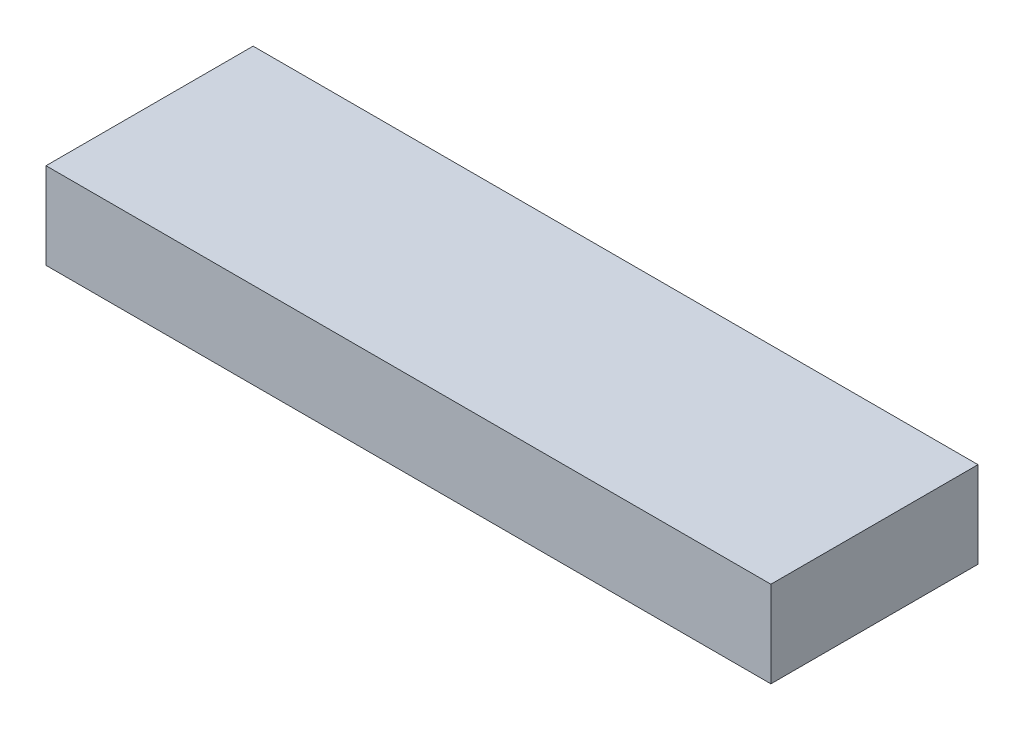
ISO-10303-21;
HEADER;
FILE_DESCRIPTION(('STEP AP214'),'2;1');
FILE_NAME('part.step','',(''),(''),'','','');
FILE_SCHEMA(('AUTOMOTIVE_DESIGN { 1 0 10303 214 1 1 1 1 }'));
ENDSEC;
DATA;
#1=APPLICATION_CONTEXT('core data for automotive mechanical design processes');
#2=APPLICATION_PROTOCOL_DEFINITION('international standard','automotive_design',2000,#1);
#3=PRODUCT_CONTEXT('',#1,'mechanical');
#4=PRODUCT('Part','Part','',(#3));
#5=PRODUCT_RELATED_PRODUCT_CATEGORY('part','',(#4));
#6=PRODUCT_DEFINITION_FORMATION('','',#4);
#7=PRODUCT_DEFINITION_CONTEXT('part definition',#1,'design');
#8=PRODUCT_DEFINITION('design','',#6,#7);
#9=PRODUCT_DEFINITION_SHAPE('','',#8);
#10=(LENGTH_UNIT() NAMED_UNIT(*) SI_UNIT(.MILLI.,.METRE.));
#11=(NAMED_UNIT(*) PLANE_ANGLE_UNIT() SI_UNIT($,.RADIAN.));
#12=(NAMED_UNIT(*) SI_UNIT($,.STERADIAN.) SOLID_ANGLE_UNIT());
#13=UNCERTAINTY_MEASURE_WITH_UNIT(LENGTH_MEASURE(1.E-05),#10,'distance_accuracy_value','');
#14=(GEOMETRIC_REPRESENTATION_CONTEXT(3) GLOBAL_UNCERTAINTY_ASSIGNED_CONTEXT((#13)) GLOBAL_UNIT_ASSIGNED_CONTEXT((#10,
#11,#12)) REPRESENTATION_CONTEXT('',''));
#15=CARTESIAN_POINT('',(0.,0.,0.));
#16=DIRECTION('',(0.,0.,1.));
#17=DIRECTION('',(1.,0.,0.));
#18=AXIS2_PLACEMENT_3D('',#15,#16,#17);
#19=CARTESIAN_POINT('',(105.,25.,30.));
#20=DIRECTION('',(-1.,0.,0.));
#21=DIRECTION('',(0.,0.,1.));
#22=AXIS2_PLACEMENT_3D('',#19,#20,#21);
#23=PLANE('',#22);
#24=DIRECTION('',(0.,0.,-1.));
#25=VECTOR('',#24,1.);
#26=CARTESIAN_POINT('',(105.,0.,30.));
#27=LINE('',#26,#25);
#28=CARTESIAN_POINT('',(105.,0.,30.));
#29=VERTEX_POINT('',#28);
#30=CARTESIAN_POINT('',(105.,0.,-30.));
#31=VERTEX_POINT('',#30);
#32=EDGE_CURVE('E102',#29,#31,#27,.T.);
#33=ORIENTED_EDGE('',*,*,#32,.T.);
#34=DIRECTION('',(0.,-1.,0.));
#35=VECTOR('',#34,1.);
#36=CARTESIAN_POINT('',(105.,25.,-30.));
#37=LINE('',#36,#35);
#38=CARTESIAN_POINT('',(105.,25.,-30.));
#39=VERTEX_POINT('',#38);
#40=EDGE_CURVE('E11',#39,#31,#37,.T.);
#41=ORIENTED_EDGE('',*,*,#40,.F.);
#42=DIRECTION('',(0.,0.,-1.));
#43=VECTOR('',#42,1.);
#44=CARTESIAN_POINT('',(105.,25.,30.));
#45=LINE('',#44,#43);
#46=CARTESIAN_POINT('',(105.,25.,30.));
#47=VERTEX_POINT('',#46);
#48=EDGE_CURVE('E90',#47,#39,#45,.T.);
#49=ORIENTED_EDGE('',*,*,#48,.F.);
#50=DIRECTION('',(0.,-1.,0.));
#51=VECTOR('',#50,1.);
#52=CARTESIAN_POINT('',(105.,25.,30.));
#53=LINE('',#52,#51);
#54=EDGE_CURVE('E98',#47,#29,#53,.T.);
#55=ORIENTED_EDGE('',*,*,#54,.T.);
#56=EDGE_LOOP('',(#33,#41,#49,#55));
#57=FACE_BOUND('',#56,.T.);
#58=ADVANCED_FACE('F39',(#57),#23,.F.);
#59=CARTESIAN_POINT('',(-105.,25.,-30.));
#60=DIRECTION('',(0.,0.,1.));
#61=DIRECTION('',(1.,0.,0.));
#62=AXIS2_PLACEMENT_3D('',#59,#60,#61);
#63=PLANE('',#62);
#64=DIRECTION('',(-1.,0.,0.));
#65=VECTOR('',#64,1.);
#66=CARTESIAN_POINT('',(-105.,0.,-30.));
#67=LINE('',#66,#65);
#68=CARTESIAN_POINT('',(-105.,0.,-30.));
#69=VERTEX_POINT('',#68);
#70=EDGE_CURVE('E94',#31,#69,#67,.T.);
#71=ORIENTED_EDGE('',*,*,#70,.T.);
#72=DIRECTION('',(0.,-1.,0.));
#73=VECTOR('',#72,1.);
#74=CARTESIAN_POINT('',(-105.,25.,-30.));
#75=LINE('',#74,#73);
#76=CARTESIAN_POINT('',(-105.,25.,-30.));
#77=VERTEX_POINT('',#76);
#78=EDGE_CURVE('E47',#77,#69,#75,.T.);
#79=ORIENTED_EDGE('',*,*,#78,.F.);
#80=DIRECTION('',(-1.,0.,0.));
#81=VECTOR('',#80,1.);
#82=CARTESIAN_POINT('',(-105.,25.,-30.));
#83=LINE('',#82,#81);
#84=EDGE_CURVE('E85',#39,#77,#83,.T.);
#85=ORIENTED_EDGE('',*,*,#84,.F.);
#86=ORIENTED_EDGE('',*,*,#40,.T.);
#87=EDGE_LOOP('',(#71,#79,#85,#86));
#88=FACE_BOUND('',#87,.T.);
#89=ADVANCED_FACE('F93',(#88),#63,.F.);
#90=CARTESIAN_POINT('',(-105.,25.,30.));
#91=DIRECTION('',(1.,0.,0.));
#92=DIRECTION('',(0.,0.,-1.));
#93=AXIS2_PLACEMENT_3D('',#90,#91,#92);
#94=PLANE('',#93);
#95=DIRECTION('',(0.,0.,1.));
#96=VECTOR('',#95,1.);
#97=CARTESIAN_POINT('',(-105.,0.,30.));
#98=LINE('',#97,#96);
#99=CARTESIAN_POINT('',(-105.,0.,30.));
#100=VERTEX_POINT('',#99);
#101=EDGE_CURVE('E72',#69,#100,#98,.T.);
#102=ORIENTED_EDGE('',*,*,#101,.T.);
#103=DIRECTION('',(0.,-1.,0.));
#104=VECTOR('',#103,1.);
#105=CARTESIAN_POINT('',(-105.,25.,30.));
#106=LINE('',#105,#104);
#107=CARTESIAN_POINT('',(-105.,25.,30.));
#108=VERTEX_POINT('',#107);
#109=EDGE_CURVE('E95',#108,#100,#106,.T.);
#110=ORIENTED_EDGE('',*,*,#109,.F.);
#111=DIRECTION('',(0.,0.,1.));
#112=VECTOR('',#111,1.);
#113=CARTESIAN_POINT('',(-105.,25.,30.));
#114=LINE('',#113,#112);
#115=EDGE_CURVE('E88',#77,#108,#114,.T.);
#116=ORIENTED_EDGE('',*,*,#115,.F.);
#117=ORIENTED_EDGE('',*,*,#78,.T.);
#118=EDGE_LOOP('',(#102,#110,#116,#117));
#119=FACE_BOUND('',#118,.T.);
#120=ADVANCED_FACE('F96',(#119),#94,.F.);
#121=CARTESIAN_POINT('',(-105.,25.,30.));
#122=DIRECTION('',(0.,0.,-1.));
#123=DIRECTION('',(-1.,0.,0.));
#124=AXIS2_PLACEMENT_3D('',#121,#122,#123);
#125=PLANE('',#124);
#126=DIRECTION('',(1.,0.,0.));
#127=VECTOR('',#126,1.);
#128=CARTESIAN_POINT('',(-105.,0.,30.));
#129=LINE('',#128,#127);
#130=EDGE_CURVE('E78',#100,#29,#129,.T.);
#131=ORIENTED_EDGE('',*,*,#130,.T.);
#132=ORIENTED_EDGE('',*,*,#54,.F.);
#133=DIRECTION('',(1.,0.,0.));
#134=VECTOR('',#133,1.);
#135=CARTESIAN_POINT('',(-105.,25.,30.));
#136=LINE('',#135,#134);
#137=EDGE_CURVE('E55',#108,#47,#136,.T.);
#138=ORIENTED_EDGE('',*,*,#137,.F.);
#139=ORIENTED_EDGE('',*,*,#109,.T.);
#140=EDGE_LOOP('',(#131,#132,#138,#139));
#141=FACE_BOUND('',#140,.T.);
#142=ADVANCED_FACE('F109',(#141),#125,.F.);
#143=CARTESIAN_POINT('',(0.,25.,0.));
#144=DIRECTION('',(0.,-1.,0.));
#145=DIRECTION('',(0.,0.,-1.));
#146=AXIS2_PLACEMENT_3D('',#143,#144,#145);
#147=PLANE('',#146);
#148=ORIENTED_EDGE('',*,*,#48,.T.);
#149=ORIENTED_EDGE('',*,*,#84,.T.);
#150=ORIENTED_EDGE('',*,*,#115,.T.);
#151=ORIENTED_EDGE('',*,*,#137,.T.);
#152=EDGE_LOOP('',(#148,#149,#150,#151));
#153=FACE_BOUND('',#152,.T.);
#154=ADVANCED_FACE('F86',(#153),#147,.F.);
#155=CARTESIAN_POINT('',(0.,0.,0.));
#156=DIRECTION('',(0.,-1.,0.));
#157=DIRECTION('',(0.,0.,-1.));
#158=AXIS2_PLACEMENT_3D('',#155,#156,#157);
#159=PLANE('',#158);
#160=ORIENTED_EDGE('',*,*,#32,.F.);
#161=ORIENTED_EDGE('',*,*,#130,.F.);
#162=ORIENTED_EDGE('',*,*,#101,.F.);
#163=ORIENTED_EDGE('',*,*,#70,.F.);
#164=EDGE_LOOP('',(#160,#161,#162,#163));
#165=FACE_BOUND('',#164,.T.);
#166=ADVANCED_FACE('F112',(#165),#159,.T.);
#167=CLOSED_SHELL('',(#58,#89,#120,#142,#154,#166));
#168=MANIFOLD_SOLID_BREP('B2',#167);
#169=ADVANCED_BREP_SHAPE_REPRESENTATION('',(#18,#168),#14);
#170=SHAPE_DEFINITION_REPRESENTATION(#9,#169);
ENDSEC;
END-ISO-10303-21;
